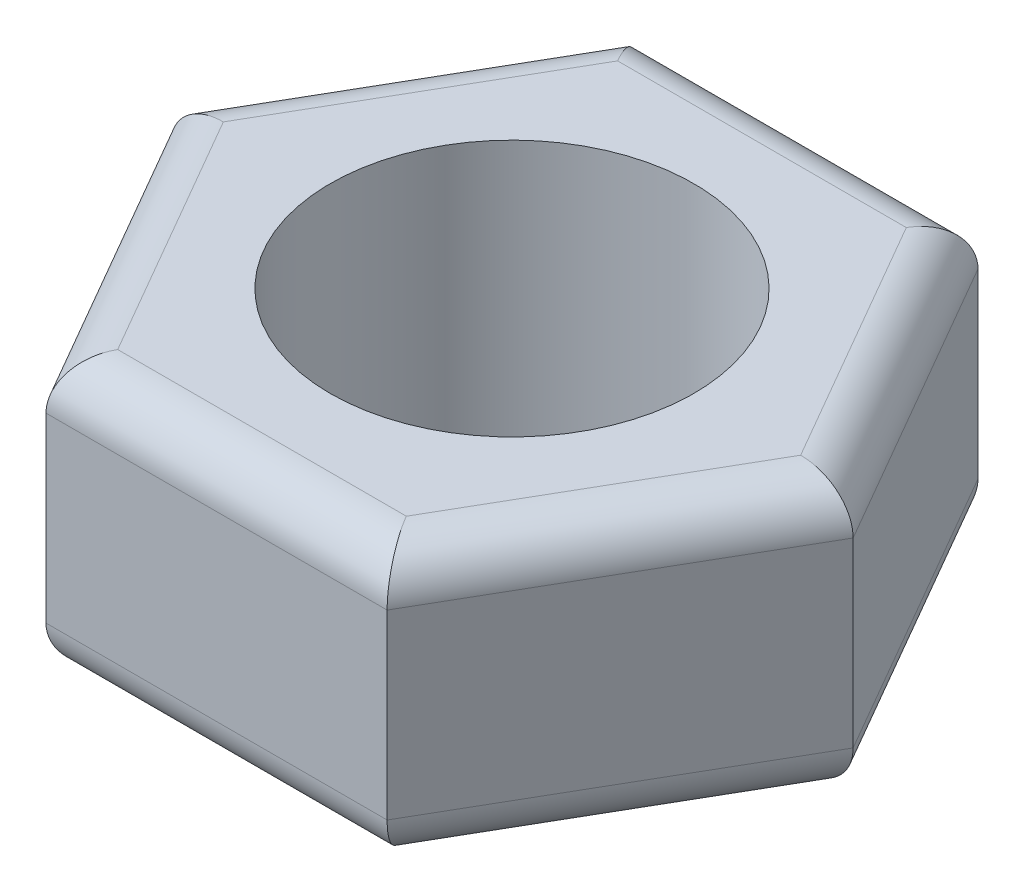
ISO-10303-21;
HEADER;
FILE_DESCRIPTION(('STEP AP214'),'2;1');
FILE_NAME('part.step','',(''),(''),'','','');
FILE_SCHEMA(('AUTOMOTIVE_DESIGN { 1 0 10303 214 1 1 1 1 }'));
ENDSEC;
DATA;
#1=APPLICATION_CONTEXT('core data for automotive mechanical design processes');
#2=APPLICATION_PROTOCOL_DEFINITION('international standard','automotive_design',2000,#1);
#3=PRODUCT_CONTEXT('',#1,'mechanical');
#4=PRODUCT('Part','Part','',(#3));
#5=PRODUCT_RELATED_PRODUCT_CATEGORY('part','',(#4));
#6=PRODUCT_DEFINITION_FORMATION('','',#4);
#7=PRODUCT_DEFINITION_CONTEXT('part definition',#1,'design');
#8=PRODUCT_DEFINITION('design','',#6,#7);
#9=PRODUCT_DEFINITION_SHAPE('','',#8);
#10=(LENGTH_UNIT() NAMED_UNIT(*) SI_UNIT(.MILLI.,.METRE.));
#11=(NAMED_UNIT(*) PLANE_ANGLE_UNIT() SI_UNIT($,.RADIAN.));
#12=(NAMED_UNIT(*) SI_UNIT($,.STERADIAN.) SOLID_ANGLE_UNIT());
#13=UNCERTAINTY_MEASURE_WITH_UNIT(LENGTH_MEASURE(1.E-05),#10,'distance_accuracy_value','');
#14=(GEOMETRIC_REPRESENTATION_CONTEXT(3) GLOBAL_UNCERTAINTY_ASSIGNED_CONTEXT((#13)) GLOBAL_UNIT_ASSIGNED_CONTEXT((#10,
#11,#12)) REPRESENTATION_CONTEXT('',''));
#15=CARTESIAN_POINT('',(0.,0.,0.));
#16=DIRECTION('',(0.,0.,1.));
#17=DIRECTION('',(1.,0.,0.));
#18=AXIS2_PLACEMENT_3D('',#15,#16,#17);
#19=CARTESIAN_POINT('',(0.,6.,0.));
#20=DIRECTION('',(0.,1.,0.));
#21=DIRECTION('',(0.,0.,1.));
#22=AXIS2_PLACEMENT_3D('',#19,#20,#21);
#23=PLANE('',#22);
#24=DIRECTION('',(0.5,0.,0.866025403784439));
#25=VECTOR('',#24,1.);
#26=CARTESIAN_POINT('',(-2.88675134594813,6.,6.));
#27=LINE('',#26,#25);
#28=CARTESIAN_POINT('',(-6.35085296108588,6.,0.));
#29=VERTEX_POINT('',#28);
#30=CARTESIAN_POINT('',(-3.17542648054294,6.,5.5));
#31=VERTEX_POINT('',#30);
#32=EDGE_CURVE('E42',#29,#31,#27,.T.);
#33=ORIENTED_EDGE('',*,*,#32,.T.);
#34=DIRECTION('',(1.,0.,0.));
#35=VECTOR('',#34,1.);
#36=CARTESIAN_POINT('',(3.75277674973257,6.,5.5));
#37=LINE('',#36,#35);
#38=CARTESIAN_POINT('',(3.17542648054295,6.,5.5));
#39=VERTEX_POINT('',#38);
#40=EDGE_CURVE('E11',#31,#39,#37,.T.);
#41=ORIENTED_EDGE('',*,*,#40,.T.);
#42=DIRECTION('',(0.5,0.,-0.866025403784439));
#43=VECTOR('',#42,1.);
#44=CARTESIAN_POINT('',(6.6395280956807,6.,-0.499999999999995));
#45=LINE('',#44,#43);
#46=CARTESIAN_POINT('',(6.35085296108588,6.,0.));
#47=VERTEX_POINT('',#46);
#48=EDGE_CURVE('E193',#39,#47,#45,.T.);
#49=ORIENTED_EDGE('',*,*,#48,.T.);
#50=DIRECTION('',(-0.5,0.,-0.866025403784439));
#51=VECTOR('',#50,1.);
#52=CARTESIAN_POINT('',(2.88675134594812,6.,-6.));
#53=LINE('',#52,#51);
#54=CARTESIAN_POINT('',(3.17542648054294,6.,-5.5));
#55=VERTEX_POINT('',#54);
#56=EDGE_CURVE('E195',#47,#55,#53,.T.);
#57=ORIENTED_EDGE('',*,*,#56,.T.);
#58=DIRECTION('',(-1.,0.,0.));
#59=VECTOR('',#58,1.);
#60=CARTESIAN_POINT('',(-3.75277674973257,6.,-5.5));
#61=LINE('',#60,#59);
#62=CARTESIAN_POINT('',(-3.17542648054294,6.,-5.5));
#63=VERTEX_POINT('',#62);
#64=EDGE_CURVE('E150',#55,#63,#61,.T.);
#65=ORIENTED_EDGE('',*,*,#64,.T.);
#66=DIRECTION('',(-0.5,0.,0.866025403784439));
#67=VECTOR('',#66,1.);
#68=CARTESIAN_POINT('',(-6.6395280956807,6.,0.500000000000001));
#69=LINE('',#68,#67);
#70=EDGE_CURVE('E53',#63,#29,#69,.T.);
#71=ORIENTED_EDGE('',*,*,#70,.T.);
#72=EDGE_LOOP('',(#33,#41,#49,#57,#65,#71));
#73=FACE_BOUND('',#72,.T.);
#74=CARTESIAN_POINT('',(0.,6.,0.));
#75=DIRECTION('',(0.,1.,0.));
#76=DIRECTION('',(0.,0.,1.));
#77=AXIS2_PLACEMENT_3D('',#74,#75,#76);
#78=CIRCLE('',#77,4.);
#79=CARTESIAN_POINT('',(0.,6.,4.));
#80=VERTEX_POINT('',#79);
#81=EDGE_CURVE('E246',#80,#80,#78,.T.);
#82=ORIENTED_EDGE('',*,*,#81,.F.);
#83=EDGE_LOOP('',(#82));
#84=FACE_BOUND('',#83,.T.);
#85=ADVANCED_FACE('F33',(#73,#84),#23,.T.);
#86=CARTESIAN_POINT('',(0.,0.,0.));
#87=DIRECTION('',(0.,1.,0.));
#88=DIRECTION('',(0.,0.,1.));
#89=AXIS2_PLACEMENT_3D('',#86,#87,#88);
#90=PLANE('',#89);
#91=DIRECTION('',(-1.,0.,0.));
#92=VECTOR('',#91,1.);
#93=CARTESIAN_POINT('',(0.,0.,-5.5));
#94=LINE('',#93,#92);
#95=CARTESIAN_POINT('',(-3.17542648054294,0.,-5.5));
#96=VERTEX_POINT('',#95);
#97=CARTESIAN_POINT('',(3.17542648054294,0.,-5.5));
#98=VERTEX_POINT('',#97);
#99=EDGE_CURVE('E171',#96,#98,#94,.F.);
#100=ORIENTED_EDGE('',*,*,#99,.T.);
#101=DIRECTION('',(-0.5,0.,-0.866025403784439));
#102=VECTOR('',#101,1.);
#103=CARTESIAN_POINT('',(4.76313972081441,0.,-2.75));
#104=LINE('',#103,#102);
#105=CARTESIAN_POINT('',(6.35085296108589,0.,0.));
#106=VERTEX_POINT('',#105);
#107=EDGE_CURVE('E134',#98,#106,#104,.F.);
#108=ORIENTED_EDGE('',*,*,#107,.T.);
#109=DIRECTION('',(0.5,0.,-0.866025403784439));
#110=VECTOR('',#109,1.);
#111=CARTESIAN_POINT('',(4.76313972081442,0.,2.75));
#112=LINE('',#111,#110);
#113=CARTESIAN_POINT('',(3.17542648054295,0.,5.5));
#114=VERTEX_POINT('',#113);
#115=EDGE_CURVE('E160',#106,#114,#112,.F.);
#116=ORIENTED_EDGE('',*,*,#115,.T.);
#117=DIRECTION('',(1.,0.,0.));
#118=VECTOR('',#117,1.);
#119=CARTESIAN_POINT('',(0.,0.,5.5));
#120=LINE('',#119,#118);
#121=CARTESIAN_POINT('',(-3.17542648054294,0.,5.5));
#122=VERTEX_POINT('',#121);
#123=EDGE_CURVE('E165',#114,#122,#120,.F.);
#124=ORIENTED_EDGE('',*,*,#123,.T.);
#125=DIRECTION('',(0.5,0.,0.866025403784439));
#126=VECTOR('',#125,1.);
#127=CARTESIAN_POINT('',(-4.76313972081441,0.,2.75));
#128=LINE('',#127,#126);
#129=CARTESIAN_POINT('',(-6.35085296108588,0.,0.));
#130=VERTEX_POINT('',#129);
#131=EDGE_CURVE('E167',#122,#130,#128,.F.);
#132=ORIENTED_EDGE('',*,*,#131,.T.);
#133=DIRECTION('',(-0.5,0.,0.866025403784439));
#134=VECTOR('',#133,1.);
#135=CARTESIAN_POINT('',(-4.76313972081441,0.,-2.75));
#136=LINE('',#135,#134);
#137=EDGE_CURVE('E169',#130,#96,#136,.F.);
#138=ORIENTED_EDGE('',*,*,#137,.T.);
#139=EDGE_LOOP('',(#100,#108,#116,#124,#132,#138));
#140=FACE_BOUND('',#139,.T.);
#141=CARTESIAN_POINT('',(0.,0.,0.));
#142=DIRECTION('',(0.,1.,0.));
#143=DIRECTION('',(0.,0.,1.));
#144=AXIS2_PLACEMENT_3D('',#141,#142,#143);
#145=CIRCLE('',#144,4.);
#146=CARTESIAN_POINT('',(0.,0.,4.));
#147=VERTEX_POINT('',#146);
#148=EDGE_CURVE('E216',#147,#147,#145,.T.);
#149=ORIENTED_EDGE('',*,*,#148,.T.);
#150=EDGE_LOOP('',(#149));
#151=FACE_BOUND('',#150,.T.);
#152=ADVANCED_FACE('F256',(#140,#151),#90,.F.);
#153=CARTESIAN_POINT('',(3.75277674973257,6.,6.5));
#154=DIRECTION('',(-0.866025403784438,0.,-0.5));
#155=DIRECTION('',(-0.5,0.,0.866025403784439));
#156=AXIS2_PLACEMENT_3D('',#153,#154,#155);
#157=PLANE('',#156);
#158=DIRECTION('',(0.,-1.,0.));
#159=VECTOR('',#158,1.);
#160=CARTESIAN_POINT('',(3.75277674973257,6.,6.5));
#161=LINE('',#160,#159);
#162=CARTESIAN_POINT('',(3.75277674973257,5.,6.5));
#163=VERTEX_POINT('',#162);
#164=CARTESIAN_POINT('',(3.75277674973257,1.,6.5));
#165=VERTEX_POINT('',#164);
#166=EDGE_CURVE('E241',#163,#165,#161,.T.);
#167=ORIENTED_EDGE('',*,*,#166,.T.);
#168=DIRECTION('',(0.5,0.,-0.866025403784439));
#169=VECTOR('',#168,1.);
#170=CARTESIAN_POINT('',(3.75277674973257,1.,6.5));
#171=LINE('',#170,#169);
#172=CARTESIAN_POINT('',(7.50555349946514,1.,0.));
#173=VERTEX_POINT('',#172);
#174=EDGE_CURVE('E191',#165,#173,#171,.T.);
#175=ORIENTED_EDGE('',*,*,#174,.T.);
#176=DIRECTION('',(0.,-1.,0.));
#177=VECTOR('',#176,1.);
#178=CARTESIAN_POINT('',(7.50555349946514,6.,0.));
#179=LINE('',#178,#177);
#180=CARTESIAN_POINT('',(7.50555349946514,5.,0.));
#181=VERTEX_POINT('',#180);
#182=EDGE_CURVE('E145',#181,#173,#179,.T.);
#183=ORIENTED_EDGE('',*,*,#182,.F.);
#184=DIRECTION('',(0.5,0.,-0.866025403784439));
#185=VECTOR('',#184,1.);
#186=CARTESIAN_POINT('',(3.75277674973257,5.,6.5));
#187=LINE('',#186,#185);
#188=EDGE_CURVE('E189',#181,#163,#187,.F.);
#189=ORIENTED_EDGE('',*,*,#188,.T.);
#190=EDGE_LOOP('',(#167,#175,#183,#189));
#191=FACE_BOUND('',#190,.T.);
#192=ADVANCED_FACE('F261',(#191),#157,.F.);
#193=CARTESIAN_POINT('',(7.50555349946514,6.,0.));
#194=DIRECTION('',(-0.866025403784438,0.,0.5));
#195=DIRECTION('',(0.5,0.,0.866025403784439));
#196=AXIS2_PLACEMENT_3D('',#193,#194,#195);
#197=PLANE('',#196);
#198=ORIENTED_EDGE('',*,*,#182,.T.);
#199=DIRECTION('',(-0.5,0.,-0.866025403784439));
#200=VECTOR('',#199,1.);
#201=CARTESIAN_POINT('',(7.50555349946514,1.,0.));
#202=LINE('',#201,#200);
#203=CARTESIAN_POINT('',(3.75277674973256,1.,-6.5));
#204=VERTEX_POINT('',#203);
#205=EDGE_CURVE('E144',#173,#204,#202,.T.);
#206=ORIENTED_EDGE('',*,*,#205,.T.);
#207=DIRECTION('',(0.,-1.,0.));
#208=VECTOR('',#207,1.);
#209=CARTESIAN_POINT('',(3.75277674973256,6.,-6.5));
#210=LINE('',#209,#208);
#211=CARTESIAN_POINT('',(3.75277674973256,5.,-6.5));
#212=VERTEX_POINT('',#211);
#213=EDGE_CURVE('E126',#212,#204,#210,.T.);
#214=ORIENTED_EDGE('',*,*,#213,.F.);
#215=DIRECTION('',(-0.5,0.,-0.866025403784439));
#216=VECTOR('',#215,1.);
#217=CARTESIAN_POINT('',(7.50555349946514,5.,0.));
#218=LINE('',#217,#216);
#219=EDGE_CURVE('E141',#212,#181,#218,.F.);
#220=ORIENTED_EDGE('',*,*,#219,.T.);
#221=EDGE_LOOP('',(#198,#206,#214,#220));
#222=FACE_BOUND('',#221,.T.);
#223=ADVANCED_FACE('F139',(#222),#197,.F.);
#224=CARTESIAN_POINT('',(3.75277674973256,6.,-6.5));
#225=DIRECTION('',(0.,0.,1.));
#226=DIRECTION('',(1.,0.,0.));
#227=AXIS2_PLACEMENT_3D('',#224,#225,#226);
#228=PLANE('',#227);
#229=ORIENTED_EDGE('',*,*,#213,.T.);
#230=DIRECTION('',(-1.,0.,0.));
#231=VECTOR('',#230,1.);
#232=CARTESIAN_POINT('',(3.75277674973256,1.,-6.5));
#233=LINE('',#232,#231);
#234=CARTESIAN_POINT('',(-3.75277674973257,1.,-6.5));
#235=VERTEX_POINT('',#234);
#236=EDGE_CURVE('E133',#204,#235,#233,.T.);
#237=ORIENTED_EDGE('',*,*,#236,.T.);
#238=DIRECTION('',(0.,-1.,0.));
#239=VECTOR('',#238,1.);
#240=CARTESIAN_POINT('',(-3.75277674973257,6.,-6.5));
#241=LINE('',#240,#239);
#242=CARTESIAN_POINT('',(-3.75277674973257,5.,-6.5));
#243=VERTEX_POINT('',#242);
#244=EDGE_CURVE('E128',#243,#235,#241,.T.);
#245=ORIENTED_EDGE('',*,*,#244,.F.);
#246=DIRECTION('',(-1.,0.,0.));
#247=VECTOR('',#246,1.);
#248=CARTESIAN_POINT('',(3.75277674973256,5.,-6.5));
#249=LINE('',#248,#247);
#250=EDGE_CURVE('E123',#243,#212,#249,.F.);
#251=ORIENTED_EDGE('',*,*,#250,.T.);
#252=EDGE_LOOP('',(#229,#237,#245,#251));
#253=FACE_BOUND('',#252,.T.);
#254=ADVANCED_FACE('F125',(#253),#228,.F.);
#255=CARTESIAN_POINT('',(-3.75277674973257,6.,-6.5));
#256=DIRECTION('',(0.866025403784439,0.,0.5));
#257=DIRECTION('',(0.5,0.,-0.866025403784439));
#258=AXIS2_PLACEMENT_3D('',#255,#256,#257);
#259=PLANE('',#258);
#260=ORIENTED_EDGE('',*,*,#244,.T.);
#261=DIRECTION('',(-0.5,0.,0.866025403784439));
#262=VECTOR('',#261,1.);
#263=CARTESIAN_POINT('',(-3.75277674973257,1.,-6.5));
#264=LINE('',#263,#262);
#265=CARTESIAN_POINT('',(-7.50555349946513,1.,0.));
#266=VERTEX_POINT('',#265);
#267=EDGE_CURVE('E178',#235,#266,#264,.T.);
#268=ORIENTED_EDGE('',*,*,#267,.T.);
#269=DIRECTION('',(0.,-1.,0.));
#270=VECTOR('',#269,1.);
#271=CARTESIAN_POINT('',(-7.50555349946513,6.,0.));
#272=LINE('',#271,#270);
#273=CARTESIAN_POINT('',(-7.50555349946513,5.,0.));
#274=VERTEX_POINT('',#273);
#275=EDGE_CURVE('E234',#274,#266,#272,.T.);
#276=ORIENTED_EDGE('',*,*,#275,.F.);
#277=DIRECTION('',(-0.5,0.,0.866025403784439));
#278=VECTOR('',#277,1.);
#279=CARTESIAN_POINT('',(-3.75277674973257,5.,-6.5));
#280=LINE('',#279,#278);
#281=EDGE_CURVE('E176',#274,#243,#280,.F.);
#282=ORIENTED_EDGE('',*,*,#281,.T.);
#283=EDGE_LOOP('',(#260,#268,#276,#282));
#284=FACE_BOUND('',#283,.T.);
#285=ADVANCED_FACE('F231',(#284),#259,.F.);
#286=CARTESIAN_POINT('',(-7.50555349946513,6.,0.));
#287=DIRECTION('',(0.866025403784439,0.,-0.5));
#288=DIRECTION('',(-0.5,0.,-0.866025403784439));
#289=AXIS2_PLACEMENT_3D('',#286,#287,#288);
#290=PLANE('',#289);
#291=ORIENTED_EDGE('',*,*,#275,.T.);
#292=DIRECTION('',(0.5,0.,0.866025403784439));
#293=VECTOR('',#292,1.);
#294=CARTESIAN_POINT('',(-7.50555349946513,1.,0.));
#295=LINE('',#294,#293);
#296=CARTESIAN_POINT('',(-3.75277674973257,1.,6.5));
#297=VERTEX_POINT('',#296);
#298=EDGE_CURVE('E182',#266,#297,#295,.T.);
#299=ORIENTED_EDGE('',*,*,#298,.T.);
#300=DIRECTION('',(0.,-1.,0.));
#301=VECTOR('',#300,1.);
#302=CARTESIAN_POINT('',(-3.75277674973257,6.,6.5));
#303=LINE('',#302,#301);
#304=CARTESIAN_POINT('',(-3.75277674973257,5.,6.5));
#305=VERTEX_POINT('',#304);
#306=EDGE_CURVE('E237',#305,#297,#303,.T.);
#307=ORIENTED_EDGE('',*,*,#306,.F.);
#308=DIRECTION('',(0.5,0.,0.866025403784439));
#309=VECTOR('',#308,1.);
#310=CARTESIAN_POINT('',(-7.50555349946514,5.,0.));
#311=LINE('',#310,#309);
#312=EDGE_CURVE('E180',#305,#274,#311,.F.);
#313=ORIENTED_EDGE('',*,*,#312,.T.);
#314=EDGE_LOOP('',(#291,#299,#307,#313));
#315=FACE_BOUND('',#314,.T.);
#316=ADVANCED_FACE('F269',(#315),#290,.F.);
#317=CARTESIAN_POINT('',(-3.75277674973257,6.,6.5));
#318=DIRECTION('',(0.,0.,-1.));
#319=DIRECTION('',(-1.,0.,0.));
#320=AXIS2_PLACEMENT_3D('',#317,#318,#319);
#321=PLANE('',#320);
#322=ORIENTED_EDGE('',*,*,#306,.T.);
#323=DIRECTION('',(1.,0.,0.));
#324=VECTOR('',#323,1.);
#325=CARTESIAN_POINT('',(-3.75277674973257,1.,6.5));
#326=LINE('',#325,#324);
#327=EDGE_CURVE('E187',#297,#165,#326,.T.);
#328=ORIENTED_EDGE('',*,*,#327,.T.);
#329=ORIENTED_EDGE('',*,*,#166,.F.);
#330=DIRECTION('',(1.,0.,0.));
#331=VECTOR('',#330,1.);
#332=CARTESIAN_POINT('',(-3.75277674973257,5.,6.5));
#333=LINE('',#332,#331);
#334=EDGE_CURVE('E184',#163,#305,#333,.F.);
#335=ORIENTED_EDGE('',*,*,#334,.T.);
#336=EDGE_LOOP('',(#322,#328,#329,#335));
#337=FACE_BOUND('',#336,.T.);
#338=ADVANCED_FACE('F266',(#337),#321,.F.);
#339=CARTESIAN_POINT('',(0.,6.,0.));
#340=DIRECTION('',(0.,-1.,0.));
#341=DIRECTION('',(0.,0.,-1.));
#342=AXIS2_PLACEMENT_3D('',#339,#340,#341);
#343=CYLINDRICAL_SURFACE('',#342,4.);
#344=ORIENTED_EDGE('',*,*,#81,.T.);
#345=EDGE_LOOP('',(#344));
#346=FACE_BOUND('',#345,.T.);
#347=ORIENTED_EDGE('',*,*,#148,.F.);
#348=EDGE_LOOP('',(#347));
#349=FACE_BOUND('',#348,.T.);
#350=ADVANCED_FACE('F252',(#346,#349),#343,.F.);
#351=CARTESIAN_POINT('',(-6.6395280956807,1.,-0.5));
#352=DIRECTION('',(0.5,0.,0.866025403784439));
#353=DIRECTION('',(0.866025403784439,0.,-0.5));
#354=AXIS2_PLACEMENT_3D('',#351,#352,#353);
#355=CYLINDRICAL_SURFACE('',#354,1.);
#356=CARTESIAN_POINT('',(-6.35085296108588,1.,0.));
#357=DIRECTION('',(0.,0.,1.));
#358=DIRECTION('',(1.,0.,0.));
#359=AXIS2_PLACEMENT_3D('',#356,#357,#358);
#360=ELLIPSE('',#359,1.15470053837925,1.);
#361=EDGE_CURVE('E210',#130,#266,#360,.F.);
#362=ORIENTED_EDGE('',*,*,#361,.F.);
#363=ORIENTED_EDGE('',*,*,#131,.F.);
#364=CARTESIAN_POINT('',(-3.17542648054294,1.,5.5));
#365=DIRECTION('',(0.866025403784439,0.,0.5));
#366=DIRECTION('',(0.5,0.,-0.866025403784439));
#367=AXIS2_PLACEMENT_3D('',#364,#365,#366);
#368=ELLIPSE('',#367,1.15470053837925,1.);
#369=EDGE_CURVE('E213',#297,#122,#368,.T.);
#370=ORIENTED_EDGE('',*,*,#369,.F.);
#371=ORIENTED_EDGE('',*,*,#298,.F.);
#372=EDGE_LOOP('',(#362,#363,#370,#371));
#373=FACE_BOUND('',#372,.T.);
#374=ADVANCED_FACE('F301',(#373),#355,.T.);
#375=CARTESIAN_POINT('',(-3.75277674973257,1.,5.5));
#376=DIRECTION('',(1.,0.,0.));
#377=DIRECTION('',(0.,0.,-1.));
#378=AXIS2_PLACEMENT_3D('',#375,#376,#377);
#379=CYLINDRICAL_SURFACE('',#378,1.);
#380=ORIENTED_EDGE('',*,*,#369,.T.);
#381=ORIENTED_EDGE('',*,*,#123,.F.);
#382=CARTESIAN_POINT('',(3.17542648054295,1.,5.5));
#383=DIRECTION('',(0.866025403784439,0.,-0.5));
#384=DIRECTION('',(-0.5,0.,-0.866025403784439));
#385=AXIS2_PLACEMENT_3D('',#382,#383,#384);
#386=ELLIPSE('',#385,1.15470053837925,1.);
#387=EDGE_CURVE('E207',#165,#114,#386,.T.);
#388=ORIENTED_EDGE('',*,*,#387,.F.);
#389=ORIENTED_EDGE('',*,*,#327,.F.);
#390=EDGE_LOOP('',(#380,#381,#388,#389));
#391=FACE_BOUND('',#390,.T.);
#392=ADVANCED_FACE('F297',(#391),#379,.T.);
#393=CARTESIAN_POINT('',(-2.88675134594813,1.,-6.));
#394=DIRECTION('',(-0.5,0.,0.866025403784439));
#395=DIRECTION('',(0.866025403784439,0.,0.5));
#396=AXIS2_PLACEMENT_3D('',#393,#394,#395);
#397=CYLINDRICAL_SURFACE('',#396,1.);
#398=ORIENTED_EDGE('',*,*,#361,.T.);
#399=ORIENTED_EDGE('',*,*,#267,.F.);
#400=CARTESIAN_POINT('',(-3.17542648054294,1.,-5.5));
#401=DIRECTION('',(-0.866025403784439,0.,0.5));
#402=DIRECTION('',(0.5,0.,0.866025403784439));
#403=AXIS2_PLACEMENT_3D('',#400,#401,#402);
#404=ELLIPSE('',#403,1.15470053837925,1.);
#405=EDGE_CURVE('E204',#96,#235,#404,.F.);
#406=ORIENTED_EDGE('',*,*,#405,.F.);
#407=ORIENTED_EDGE('',*,*,#137,.F.);
#408=EDGE_LOOP('',(#398,#399,#406,#407));
#409=FACE_BOUND('',#408,.T.);
#410=ADVANCED_FACE('F293',(#409),#397,.T.);
#411=CARTESIAN_POINT('',(2.88675134594813,1.,6.));
#412=DIRECTION('',(0.5,0.,-0.866025403784439));
#413=DIRECTION('',(-0.866025403784439,0.,-0.5));
#414=AXIS2_PLACEMENT_3D('',#411,#412,#413);
#415=CYLINDRICAL_SURFACE('',#414,1.);
#416=ORIENTED_EDGE('',*,*,#387,.T.);
#417=ORIENTED_EDGE('',*,*,#115,.F.);
#418=CARTESIAN_POINT('',(6.35085296108588,1.,0.));
#419=DIRECTION('',(0.,0.,-1.));
#420=DIRECTION('',(1.,0.,0.));
#421=AXIS2_PLACEMENT_3D('',#418,#419,#420);
#422=ELLIPSE('',#421,1.15470053837925,1.);
#423=EDGE_CURVE('E202',#173,#106,#422,.T.);
#424=ORIENTED_EDGE('',*,*,#423,.F.);
#425=ORIENTED_EDGE('',*,*,#174,.F.);
#426=EDGE_LOOP('',(#416,#417,#424,#425));
#427=FACE_BOUND('',#426,.T.);
#428=ADVANCED_FACE('F289',(#427),#415,.T.);
#429=CARTESIAN_POINT('',(3.75277674973256,1.,-5.5));
#430=DIRECTION('',(-1.,0.,0.));
#431=DIRECTION('',(0.,0.,1.));
#432=AXIS2_PLACEMENT_3D('',#429,#430,#431);
#433=CYLINDRICAL_SURFACE('',#432,1.);
#434=ORIENTED_EDGE('',*,*,#405,.T.);
#435=ORIENTED_EDGE('',*,*,#236,.F.);
#436=CARTESIAN_POINT('',(3.17542648054294,1.,-5.5));
#437=DIRECTION('',(-0.866025403784439,0.,-0.5));
#438=DIRECTION('',(-0.5,0.,0.866025403784439));
#439=AXIS2_PLACEMENT_3D('',#436,#437,#438);
#440=ELLIPSE('',#439,1.15470053837925,1.);
#441=EDGE_CURVE('E200',#98,#204,#440,.F.);
#442=ORIENTED_EDGE('',*,*,#441,.F.);
#443=ORIENTED_EDGE('',*,*,#99,.F.);
#444=EDGE_LOOP('',(#434,#435,#442,#443));
#445=FACE_BOUND('',#444,.T.);
#446=ADVANCED_FACE('F285',(#445),#433,.T.);
#447=CARTESIAN_POINT('',(6.6395280956807,1.,0.500000000000005));
#448=DIRECTION('',(-0.5,0.,-0.866025403784439));
#449=DIRECTION('',(-0.866025403784439,0.,0.5));
#450=AXIS2_PLACEMENT_3D('',#447,#448,#449);
#451=CYLINDRICAL_SURFACE('',#450,1.);
#452=ORIENTED_EDGE('',*,*,#423,.T.);
#453=ORIENTED_EDGE('',*,*,#107,.F.);
#454=ORIENTED_EDGE('',*,*,#441,.T.);
#455=ORIENTED_EDGE('',*,*,#205,.F.);
#456=EDGE_LOOP('',(#452,#453,#454,#455));
#457=FACE_BOUND('',#456,.T.);
#458=ADVANCED_FACE('F282',(#457),#451,.T.);
#459=CARTESIAN_POINT('',(0.,5.,-5.5));
#460=DIRECTION('',(1.,0.,0.));
#461=DIRECTION('',(0.,0.,-1.));
#462=AXIS2_PLACEMENT_3D('',#459,#460,#461);
#463=CYLINDRICAL_SURFACE('',#462,1.);
#464=CARTESIAN_POINT('',(3.17542648054294,5.,-5.5));
#465=DIRECTION('',(0.866025403784439,0.,0.5));
#466=DIRECTION('',(-0.5,0.,0.866025403784439));
#467=AXIS2_PLACEMENT_3D('',#464,#465,#466);
#468=ELLIPSE('',#467,1.15470053837925,1.);
#469=EDGE_CURVE('E149',#212,#55,#468,.T.);
#470=ORIENTED_EDGE('',*,*,#469,.F.);
#471=ORIENTED_EDGE('',*,*,#250,.F.);
#472=CARTESIAN_POINT('',(-3.17542648054294,5.,-5.5));
#473=DIRECTION('',(0.866025403784439,0.,-0.5));
#474=DIRECTION('',(0.5,0.,0.866025403784439));
#475=AXIS2_PLACEMENT_3D('',#472,#473,#474);
#476=ELLIPSE('',#475,1.15470053837925,1.);
#477=EDGE_CURVE('E37',#63,#243,#476,.F.);
#478=ORIENTED_EDGE('',*,*,#477,.F.);
#479=ORIENTED_EDGE('',*,*,#64,.F.);
#480=EDGE_LOOP('',(#470,#471,#478,#479));
#481=FACE_BOUND('',#480,.T.);
#482=ADVANCED_FACE('F35',(#481),#463,.T.);
#483=CARTESIAN_POINT('',(-4.76313972081441,5.,-2.75));
#484=DIRECTION('',(0.5,0.,-0.866025403784439));
#485=DIRECTION('',(-0.866025403784439,0.,-0.5));
#486=AXIS2_PLACEMENT_3D('',#483,#484,#485);
#487=CYLINDRICAL_SURFACE('',#486,1.);
#488=ORIENTED_EDGE('',*,*,#477,.T.);
#489=ORIENTED_EDGE('',*,*,#281,.F.);
#490=CARTESIAN_POINT('',(-6.35085296108588,5.,0.));
#491=DIRECTION('',(0.,0.,-1.));
#492=DIRECTION('',(1.,0.,0.));
#493=AXIS2_PLACEMENT_3D('',#490,#491,#492);
#494=ELLIPSE('',#493,1.15470053837925,1.);
#495=EDGE_CURVE('E153',#29,#274,#494,.F.);
#496=ORIENTED_EDGE('',*,*,#495,.F.);
#497=ORIENTED_EDGE('',*,*,#70,.F.);
#498=EDGE_LOOP('',(#488,#489,#496,#497));
#499=FACE_BOUND('',#498,.T.);
#500=ADVANCED_FACE('F228',(#499),#487,.T.);
#501=CARTESIAN_POINT('',(4.76313972081441,5.,-2.75));
#502=DIRECTION('',(0.5,0.,0.866025403784439));
#503=DIRECTION('',(0.866025403784439,0.,-0.5));
#504=AXIS2_PLACEMENT_3D('',#501,#502,#503);
#505=CYLINDRICAL_SURFACE('',#504,1.);
#506=ORIENTED_EDGE('',*,*,#469,.T.);
#507=ORIENTED_EDGE('',*,*,#56,.F.);
#508=CARTESIAN_POINT('',(6.35085296108588,5.,0.));
#509=DIRECTION('',(0.,0.,1.));
#510=DIRECTION('',(-1.,0.,0.));
#511=AXIS2_PLACEMENT_3D('',#508,#509,#510);
#512=ELLIPSE('',#511,1.15470053837925,1.);
#513=EDGE_CURVE('E157',#181,#47,#512,.T.);
#514=ORIENTED_EDGE('',*,*,#513,.F.);
#515=ORIENTED_EDGE('',*,*,#219,.F.);
#516=EDGE_LOOP('',(#506,#507,#514,#515));
#517=FACE_BOUND('',#516,.T.);
#518=ADVANCED_FACE('F155',(#517),#505,.T.);
#519=CARTESIAN_POINT('',(-4.76313972081441,5.,2.75));
#520=DIRECTION('',(-0.5,0.,-0.866025403784439));
#521=DIRECTION('',(-0.866025403784439,0.,0.5));
#522=AXIS2_PLACEMENT_3D('',#519,#520,#521);
#523=CYLINDRICAL_SURFACE('',#522,1.);
#524=ORIENTED_EDGE('',*,*,#495,.T.);
#525=ORIENTED_EDGE('',*,*,#312,.F.);
#526=CARTESIAN_POINT('',(-3.17542648054294,5.,5.5));
#527=DIRECTION('',(-0.866025403784439,0.,-0.5));
#528=DIRECTION('',(0.5,0.,-0.866025403784439));
#529=AXIS2_PLACEMENT_3D('',#526,#527,#528);
#530=ELLIPSE('',#529,1.15470053837925,1.);
#531=EDGE_CURVE('E219',#31,#305,#530,.F.);
#532=ORIENTED_EDGE('',*,*,#531,.F.);
#533=ORIENTED_EDGE('',*,*,#32,.F.);
#534=EDGE_LOOP('',(#524,#525,#532,#533));
#535=FACE_BOUND('',#534,.T.);
#536=ADVANCED_FACE('F225',(#535),#523,.T.);
#537=CARTESIAN_POINT('',(4.76313972081442,5.,2.75));
#538=DIRECTION('',(-0.5,0.,0.866025403784439));
#539=DIRECTION('',(0.866025403784439,0.,0.5));
#540=AXIS2_PLACEMENT_3D('',#537,#538,#539);
#541=CYLINDRICAL_SURFACE('',#540,1.);
#542=ORIENTED_EDGE('',*,*,#513,.T.);
#543=ORIENTED_EDGE('',*,*,#48,.F.);
#544=CARTESIAN_POINT('',(3.17542648054295,5.,5.5));
#545=DIRECTION('',(-0.866025403784439,0.,0.5));
#546=DIRECTION('',(0.5,0.,0.866025403784439));
#547=AXIS2_PLACEMENT_3D('',#544,#545,#546);
#548=ELLIPSE('',#547,1.15470053837925,1.);
#549=EDGE_CURVE('E217',#163,#39,#548,.T.);
#550=ORIENTED_EDGE('',*,*,#549,.F.);
#551=ORIENTED_EDGE('',*,*,#188,.F.);
#552=EDGE_LOOP('',(#542,#543,#550,#551));
#553=FACE_BOUND('',#552,.T.);
#554=ADVANCED_FACE('F309',(#553),#541,.T.);
#555=CARTESIAN_POINT('',(0.,5.,5.5));
#556=DIRECTION('',(-1.,0.,0.));
#557=DIRECTION('',(0.,0.,1.));
#558=AXIS2_PLACEMENT_3D('',#555,#556,#557);
#559=CYLINDRICAL_SURFACE('',#558,1.);
#560=ORIENTED_EDGE('',*,*,#531,.T.);
#561=ORIENTED_EDGE('',*,*,#334,.F.);
#562=ORIENTED_EDGE('',*,*,#549,.T.);
#563=ORIENTED_EDGE('',*,*,#40,.F.);
#564=EDGE_LOOP('',(#560,#561,#562,#563));
#565=FACE_BOUND('',#564,.T.);
#566=ADVANCED_FACE('F306',(#565),#559,.T.);
#567=CLOSED_SHELL('',(#85,#152,#192,#223,#254,#285,#316,#338,#350,#374,#392,#410,#428,#446,#458,
#482,#500,#518,#536,#554,#566));
#568=MANIFOLD_SOLID_BREP('B2',#567);
#569=ADVANCED_BREP_SHAPE_REPRESENTATION('',(#18,#568),#14);
#570=SHAPE_DEFINITION_REPRESENTATION(#9,#569);
ENDSEC;
END-ISO-10303-21;
